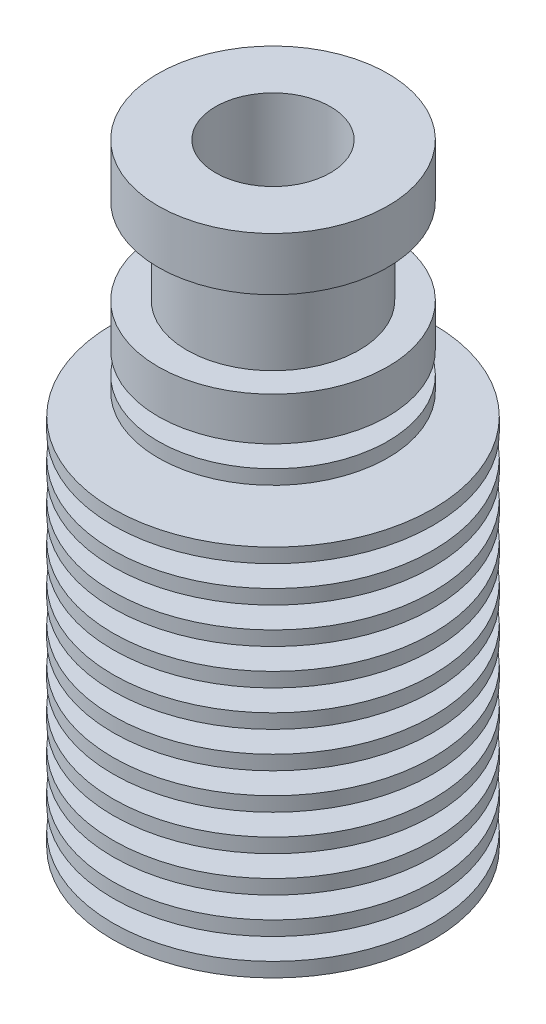
ISO-10303-21;
HEADER;
FILE_DESCRIPTION(('STEP AP214'),'2;1');
FILE_NAME('part.step','',(''),(''),'','','');
FILE_SCHEMA(('AUTOMOTIVE_DESIGN { 1 0 10303 214 1 1 1 1 }'));
ENDSEC;
DATA;
#1=APPLICATION_CONTEXT('core data for automotive mechanical design processes');
#2=APPLICATION_PROTOCOL_DEFINITION('international standard','automotive_design',2000,#1);
#3=PRODUCT_CONTEXT('',#1,'mechanical');
#4=PRODUCT('Part','Part','',(#3));
#5=PRODUCT_RELATED_PRODUCT_CATEGORY('part','',(#4));
#6=PRODUCT_DEFINITION_FORMATION('','',#4);
#7=PRODUCT_DEFINITION_CONTEXT('part definition',#1,'design');
#8=PRODUCT_DEFINITION('design','',#6,#7);
#9=PRODUCT_DEFINITION_SHAPE('','',#8);
#10=(LENGTH_UNIT() NAMED_UNIT(*) SI_UNIT(.MILLI.,.METRE.));
#11=(NAMED_UNIT(*) PLANE_ANGLE_UNIT() SI_UNIT($,.RADIAN.));
#12=(NAMED_UNIT(*) SI_UNIT($,.STERADIAN.) SOLID_ANGLE_UNIT());
#13=UNCERTAINTY_MEASURE_WITH_UNIT(LENGTH_MEASURE(1.E-05),#10,'distance_accuracy_value','');
#14=(GEOMETRIC_REPRESENTATION_CONTEXT(3) GLOBAL_UNCERTAINTY_ASSIGNED_CONTEXT((#13)) GLOBAL_UNIT_ASSIGNED_CONTEXT((#10,
#11,#12)) REPRESENTATION_CONTEXT('',''));
#15=CARTESIAN_POINT('',(0.,0.,0.));
#16=DIRECTION('',(0.,0.,1.));
#17=DIRECTION('',(1.,0.,0.));
#18=AXIS2_PLACEMENT_3D('',#15,#16,#17);
#19=CARTESIAN_POINT('',(0.,21.35,0.));
#20=DIRECTION('',(0.,1.,0.));
#21=DIRECTION('',(0.,0.,1.));
#22=AXIS2_PLACEMENT_3D('',#19,#20,#21);
#23=CYLINDRICAL_SURFACE('',#22,2.09999999999999);
#24=CARTESIAN_POINT('',(0.,-5.74170962313451,0.));
#25=DIRECTION('',(0.,1.,0.));
#26=DIRECTION('',(0.,0.,1.));
#27=AXIS2_PLACEMENT_3D('',#24,#25,#26);
#28=CIRCLE('',#27,2.09999999999999);
#29=CARTESIAN_POINT('',(0.,-5.74170962313451,2.09999999999999));
#30=VERTEX_POINT('',#29);
#31=EDGE_CURVE('E10',#30,#30,#28,.T.);
#32=ORIENTED_EDGE('',*,*,#31,.F.);
#33=EDGE_LOOP('',(#32));
#34=FACE_BOUND('',#33,.T.);
#35=CARTESIAN_POINT('',(0.,14.0196056774015,0.));
#36=DIRECTION('',(0.,1.,0.));
#37=DIRECTION('',(0.,0.,1.));
#38=AXIS2_PLACEMENT_3D('',#35,#36,#37);
#39=CIRCLE('',#38,2.09999999999999);
#40=CARTESIAN_POINT('',(0.,14.0196056774015,2.09999999999999));
#41=VERTEX_POINT('',#40);
#42=EDGE_CURVE('E216',#41,#41,#39,.T.);
#43=ORIENTED_EDGE('',*,*,#42,.T.);
#44=EDGE_LOOP('',(#43));
#45=FACE_BOUND('',#44,.T.);
#46=ADVANCED_FACE('F32',(#34,#45),#23,.F.);
#47=CARTESIAN_POINT('',(0.,-5.74170962313451,0.));
#48=DIRECTION('',(0.,-1.,0.));
#49=DIRECTION('',(0.,0.,-1.));
#50=AXIS2_PLACEMENT_3D('',#47,#48,#49);
#51=CONICAL_SURFACE('',#50,2.09999999999999,1.04719755119659);
#52=CARTESIAN_POINT('',(0.,-6.55,0.));
#53=DIRECTION('',(0.,1.,0.));
#54=DIRECTION('',(0.,0.,1.));
#55=AXIS2_PLACEMENT_3D('',#52,#53,#54);
#56=CIRCLE('',#55,3.49999999999999);
#57=CARTESIAN_POINT('',(0.,-6.55,3.49999999999999));
#58=VERTEX_POINT('',#57);
#59=EDGE_CURVE('E38',#58,#58,#56,.T.);
#60=ORIENTED_EDGE('',*,*,#59,.F.);
#61=EDGE_LOOP('',(#60));
#62=FACE_BOUND('',#61,.T.);
#63=ORIENTED_EDGE('',*,*,#31,.T.);
#64=EDGE_LOOP('',(#63));
#65=FACE_BOUND('',#64,.T.);
#66=ADVANCED_FACE('F245',(#62,#65),#51,.F.);
#67=CARTESIAN_POINT('',(0.,21.35,0.));
#68=DIRECTION('',(0.,1.,0.));
#69=DIRECTION('',(0.,0.,1.));
#70=AXIS2_PLACEMENT_3D('',#67,#68,#69);
#71=CYLINDRICAL_SURFACE('',#70,3.49999999999999);
#72=ORIENTED_EDGE('',*,*,#59,.T.);
#73=EDGE_LOOP('',(#72));
#74=FACE_BOUND('',#73,.T.);
#75=CARTESIAN_POINT('',(0.,-21.35,0.));
#76=DIRECTION('',(0.,1.,0.));
#77=DIRECTION('',(0.,0.,1.));
#78=AXIS2_PLACEMENT_3D('',#75,#76,#77);
#79=CIRCLE('',#78,3.49999999999999);
#80=CARTESIAN_POINT('',(0.,-21.35,3.49999999999999));
#81=VERTEX_POINT('',#80);
#82=EDGE_CURVE('E42',#81,#81,#79,.T.);
#83=ORIENTED_EDGE('',*,*,#82,.F.);
#84=EDGE_LOOP('',(#83));
#85=FACE_BOUND('',#84,.T.);
#86=ADVANCED_FACE('F250',(#74,#85),#71,.F.);
#87=CARTESIAN_POINT('',(0.,-21.35,0.));
#88=DIRECTION('',(0.,-1.,0.));
#89=DIRECTION('',(0.,0.,-1.));
#90=AXIS2_PLACEMENT_3D('',#87,#88,#89);
#91=PLANE('',#90);
#92=ORIENTED_EDGE('',*,*,#82,.T.);
#93=EDGE_LOOP('',(#92));
#94=FACE_BOUND('',#93,.T.);
#95=CARTESIAN_POINT('',(0.,-21.35,0.));
#96=DIRECTION('',(0.,1.,0.));
#97=DIRECTION('',(0.,0.,1.));
#98=AXIS2_PLACEMENT_3D('',#95,#96,#97);
#99=CIRCLE('',#98,11.15);
#100=CARTESIAN_POINT('',(0.,-21.35,11.15));
#101=VERTEX_POINT('',#100);
#102=EDGE_CURVE('E46',#101,#101,#99,.T.);
#103=ORIENTED_EDGE('',*,*,#102,.F.);
#104=EDGE_LOOP('',(#103));
#105=FACE_BOUND('',#104,.T.);
#106=ADVANCED_FACE('F255',(#94,#105),#91,.T.);
#107=CARTESIAN_POINT('',(0.,21.35,0.));
#108=DIRECTION('',(0.,1.,0.));
#109=DIRECTION('',(0.,0.,1.));
#110=AXIS2_PLACEMENT_3D('',#107,#108,#109);
#111=CYLINDRICAL_SURFACE('',#110,11.15);
#112=ORIENTED_EDGE('',*,*,#102,.T.);
#113=EDGE_LOOP('',(#112));
#114=FACE_BOUND('',#113,.T.);
#115=CARTESIAN_POINT('',(0.,-20.35,0.));
#116=DIRECTION('',(0.,1.,0.));
#117=DIRECTION('',(0.,0.,1.));
#118=AXIS2_PLACEMENT_3D('',#115,#116,#117);
#119=CIRCLE('',#118,11.15);
#120=CARTESIAN_POINT('',(0.,-20.35,11.15));
#121=VERTEX_POINT('',#120);
#122=EDGE_CURVE('E51',#121,#121,#119,.T.);
#123=ORIENTED_EDGE('',*,*,#122,.F.);
#124=EDGE_LOOP('',(#123));
#125=FACE_BOUND('',#124,.T.);
#126=ADVANCED_FACE('F260',(#114,#125),#111,.T.);
#127=CARTESIAN_POINT('',(0.,-20.35,0.));
#128=DIRECTION('',(0.,1.,0.));
#129=DIRECTION('',(0.,0.,1.));
#130=AXIS2_PLACEMENT_3D('',#127,#128,#129);
#131=PLANE('',#130);
#132=ORIENTED_EDGE('',*,*,#122,.T.);
#133=EDGE_LOOP('',(#132));
#134=FACE_BOUND('',#133,.T.);
#135=CARTESIAN_POINT('',(0.,-20.35,0.));
#136=DIRECTION('',(0.,1.,0.));
#137=DIRECTION('',(0.,0.,1.));
#138=AXIS2_PLACEMENT_3D('',#135,#136,#137);
#139=CIRCLE('',#138,6.25);
#140=CARTESIAN_POINT('',(0.,-20.35,6.25));
#141=VERTEX_POINT('',#140);
#142=EDGE_CURVE('E54',#141,#141,#139,.T.);
#143=ORIENTED_EDGE('',*,*,#142,.F.);
#144=EDGE_LOOP('',(#143));
#145=FACE_BOUND('',#144,.T.);
#146=ADVANCED_FACE('F264',(#134,#145),#131,.T.);
#147=CARTESIAN_POINT('',(0.,21.35,0.));
#148=DIRECTION('',(0.,1.,0.));
#149=DIRECTION('',(0.,0.,1.));
#150=AXIS2_PLACEMENT_3D('',#147,#148,#149);
#151=CYLINDRICAL_SURFACE('',#150,6.25);
#152=ORIENTED_EDGE('',*,*,#142,.T.);
#153=EDGE_LOOP('',(#152));
#154=FACE_BOUND('',#153,.T.);
#155=CARTESIAN_POINT('',(0.,-18.85,0.));
#156=DIRECTION('',(0.,1.,0.));
#157=DIRECTION('',(0.,0.,1.));
#158=AXIS2_PLACEMENT_3D('',#155,#156,#157);
#159=CIRCLE('',#158,6.25);
#160=CARTESIAN_POINT('',(0.,-18.85,6.25));
#161=VERTEX_POINT('',#160);
#162=EDGE_CURVE('E57',#161,#161,#159,.T.);
#163=ORIENTED_EDGE('',*,*,#162,.F.);
#164=EDGE_LOOP('',(#163));
#165=FACE_BOUND('',#164,.T.);
#166=ADVANCED_FACE('F268',(#154,#165),#151,.T.);
#167=CARTESIAN_POINT('',(0.,-18.85,0.));
#168=DIRECTION('',(0.,-1.,0.));
#169=DIRECTION('',(0.,0.,-1.));
#170=AXIS2_PLACEMENT_3D('',#167,#168,#169);
#171=PLANE('',#170);
#172=ORIENTED_EDGE('',*,*,#162,.T.);
#173=EDGE_LOOP('',(#172));
#174=FACE_BOUND('',#173,.T.);
#175=CARTESIAN_POINT('',(0.,-18.85,0.));
#176=DIRECTION('',(0.,1.,0.));
#177=DIRECTION('',(0.,0.,1.));
#178=AXIS2_PLACEMENT_3D('',#175,#176,#177);
#179=CIRCLE('',#178,11.15);
#180=CARTESIAN_POINT('',(0.,-18.85,11.15));
#181=VERTEX_POINT('',#180);
#182=EDGE_CURVE('E60',#181,#181,#179,.T.);
#183=ORIENTED_EDGE('',*,*,#182,.F.);
#184=EDGE_LOOP('',(#183));
#185=FACE_BOUND('',#184,.T.);
#186=ADVANCED_FACE('F272',(#174,#185),#171,.T.);
#187=CARTESIAN_POINT('',(0.,21.35,0.));
#188=DIRECTION('',(0.,1.,0.));
#189=DIRECTION('',(0.,0.,1.));
#190=AXIS2_PLACEMENT_3D('',#187,#188,#189);
#191=CYLINDRICAL_SURFACE('',#190,11.15);
#192=CARTESIAN_POINT('',(0.,-17.85,0.));
#193=DIRECTION('',(0.,1.,0.));
#194=DIRECTION('',(0.,0.,1.));
#195=AXIS2_PLACEMENT_3D('',#192,#193,#194);
#196=CIRCLE('',#195,11.15);
#197=CARTESIAN_POINT('',(0.,-17.85,11.15));
#198=VERTEX_POINT('',#197);
#199=EDGE_CURVE('E63',#198,#198,#196,.T.);
#200=ORIENTED_EDGE('',*,*,#199,.F.);
#201=EDGE_LOOP('',(#200));
#202=FACE_BOUND('',#201,.T.);
#203=ORIENTED_EDGE('',*,*,#182,.T.);
#204=EDGE_LOOP('',(#203));
#205=FACE_BOUND('',#204,.T.);
#206=ADVANCED_FACE('F276',(#202,#205),#191,.T.);
#207=CARTESIAN_POINT('',(0.,-17.85,0.));
#208=DIRECTION('',(0.,1.,0.));
#209=DIRECTION('',(0.,0.,1.));
#210=AXIS2_PLACEMENT_3D('',#207,#208,#209);
#211=PLANE('',#210);
#212=ORIENTED_EDGE('',*,*,#199,.T.);
#213=EDGE_LOOP('',(#212));
#214=FACE_BOUND('',#213,.T.);
#215=CARTESIAN_POINT('',(0.,-17.85,0.));
#216=DIRECTION('',(0.,1.,0.));
#217=DIRECTION('',(0.,0.,1.));
#218=AXIS2_PLACEMENT_3D('',#215,#216,#217);
#219=CIRCLE('',#218,6.05);
#220=CARTESIAN_POINT('',(0.,-17.85,6.05));
#221=VERTEX_POINT('',#220);
#222=EDGE_CURVE('E66',#221,#221,#219,.T.);
#223=ORIENTED_EDGE('',*,*,#222,.F.);
#224=EDGE_LOOP('',(#223));
#225=FACE_BOUND('',#224,.T.);
#226=ADVANCED_FACE('F280',(#214,#225),#211,.T.);
#227=CARTESIAN_POINT('',(0.,21.35,0.));
#228=DIRECTION('',(0.,1.,0.));
#229=DIRECTION('',(0.,0.,1.));
#230=AXIS2_PLACEMENT_3D('',#227,#228,#229);
#231=CYLINDRICAL_SURFACE('',#230,6.05);
#232=ORIENTED_EDGE('',*,*,#222,.T.);
#233=EDGE_LOOP('',(#232));
#234=FACE_BOUND('',#233,.T.);
#235=CARTESIAN_POINT('',(0.,-16.35,0.));
#236=DIRECTION('',(0.,1.,0.));
#237=DIRECTION('',(0.,0.,1.));
#238=AXIS2_PLACEMENT_3D('',#235,#236,#237);
#239=CIRCLE('',#238,6.05);
#240=CARTESIAN_POINT('',(0.,-16.35,6.05));
#241=VERTEX_POINT('',#240);
#242=EDGE_CURVE('E69',#241,#241,#239,.T.);
#243=ORIENTED_EDGE('',*,*,#242,.F.);
#244=EDGE_LOOP('',(#243));
#245=FACE_BOUND('',#244,.T.);
#246=ADVANCED_FACE('F284',(#234,#245),#231,.T.);
#247=CARTESIAN_POINT('',(0.,-16.35,0.));
#248=DIRECTION('',(0.,1.,0.));
#249=DIRECTION('',(0.,0.,1.));
#250=AXIS2_PLACEMENT_3D('',#247,#248,#249);
#251=PLANE('',#250);
#252=CARTESIAN_POINT('',(0.,-16.35,0.));
#253=DIRECTION('',(0.,1.,0.));
#254=DIRECTION('',(0.,0.,1.));
#255=AXIS2_PLACEMENT_3D('',#252,#253,#254);
#256=CIRCLE('',#255,11.15);
#257=CARTESIAN_POINT('',(0.,-16.35,11.15));
#258=VERTEX_POINT('',#257);
#259=EDGE_CURVE('E72',#258,#258,#256,.T.);
#260=ORIENTED_EDGE('',*,*,#259,.F.);
#261=EDGE_LOOP('',(#260));
#262=FACE_BOUND('',#261,.T.);
#263=ORIENTED_EDGE('',*,*,#242,.T.);
#264=EDGE_LOOP('',(#263));
#265=FACE_BOUND('',#264,.T.);
#266=ADVANCED_FACE('F288',(#262,#265),#251,.F.);
#267=CARTESIAN_POINT('',(0.,21.35,0.));
#268=DIRECTION('',(0.,1.,0.));
#269=DIRECTION('',(0.,0.,1.));
#270=AXIS2_PLACEMENT_3D('',#267,#268,#269);
#271=CYLINDRICAL_SURFACE('',#270,11.15);
#272=CARTESIAN_POINT('',(0.,-15.35,0.));
#273=DIRECTION('',(0.,1.,0.));
#274=DIRECTION('',(0.,0.,1.));
#275=AXIS2_PLACEMENT_3D('',#272,#273,#274);
#276=CIRCLE('',#275,11.15);
#277=CARTESIAN_POINT('',(0.,-15.35,11.15));
#278=VERTEX_POINT('',#277);
#279=EDGE_CURVE('E75',#278,#278,#276,.T.);
#280=ORIENTED_EDGE('',*,*,#279,.F.);
#281=EDGE_LOOP('',(#280));
#282=FACE_BOUND('',#281,.T.);
#283=ORIENTED_EDGE('',*,*,#259,.T.);
#284=EDGE_LOOP('',(#283));
#285=FACE_BOUND('',#284,.T.);
#286=ADVANCED_FACE('F292',(#282,#285),#271,.T.);
#287=CARTESIAN_POINT('',(0.,-15.35,0.));
#288=DIRECTION('',(0.,-1.,0.));
#289=DIRECTION('',(0.,0.,-1.));
#290=AXIS2_PLACEMENT_3D('',#287,#288,#289);
#291=PLANE('',#290);
#292=CARTESIAN_POINT('',(0.,-15.35,0.));
#293=DIRECTION('',(0.,1.,0.));
#294=DIRECTION('',(0.,0.,1.));
#295=AXIS2_PLACEMENT_3D('',#292,#293,#294);
#296=CIRCLE('',#295,5.9);
#297=CARTESIAN_POINT('',(0.,-15.35,5.9));
#298=VERTEX_POINT('',#297);
#299=EDGE_CURVE('E78',#298,#298,#296,.T.);
#300=ORIENTED_EDGE('',*,*,#299,.F.);
#301=EDGE_LOOP('',(#300));
#302=FACE_BOUND('',#301,.T.);
#303=ORIENTED_EDGE('',*,*,#279,.T.);
#304=EDGE_LOOP('',(#303));
#305=FACE_BOUND('',#304,.T.);
#306=ADVANCED_FACE('F296',(#302,#305),#291,.F.);
#307=CARTESIAN_POINT('',(0.,21.35,0.));
#308=DIRECTION('',(0.,1.,0.));
#309=DIRECTION('',(0.,0.,1.));
#310=AXIS2_PLACEMENT_3D('',#307,#308,#309);
#311=CYLINDRICAL_SURFACE('',#310,5.9);
#312=CARTESIAN_POINT('',(0.,-13.85,0.));
#313=DIRECTION('',(0.,1.,0.));
#314=DIRECTION('',(0.,0.,1.));
#315=AXIS2_PLACEMENT_3D('',#312,#313,#314);
#316=CIRCLE('',#315,5.9);
#317=CARTESIAN_POINT('',(0.,-13.85,5.9));
#318=VERTEX_POINT('',#317);
#319=EDGE_CURVE('E81',#318,#318,#316,.T.);
#320=ORIENTED_EDGE('',*,*,#319,.F.);
#321=EDGE_LOOP('',(#320));
#322=FACE_BOUND('',#321,.T.);
#323=ORIENTED_EDGE('',*,*,#299,.T.);
#324=EDGE_LOOP('',(#323));
#325=FACE_BOUND('',#324,.T.);
#326=ADVANCED_FACE('F300',(#322,#325),#311,.T.);
#327=CARTESIAN_POINT('',(0.,-13.85,0.));
#328=DIRECTION('',(0.,-1.,0.));
#329=DIRECTION('',(0.,0.,-1.));
#330=AXIS2_PLACEMENT_3D('',#327,#328,#329);
#331=PLANE('',#330);
#332=ORIENTED_EDGE('',*,*,#319,.T.);
#333=EDGE_LOOP('',(#332));
#334=FACE_BOUND('',#333,.T.);
#335=CARTESIAN_POINT('',(0.,-13.85,0.));
#336=DIRECTION('',(0.,1.,0.));
#337=DIRECTION('',(0.,0.,1.));
#338=AXIS2_PLACEMENT_3D('',#335,#336,#337);
#339=CIRCLE('',#338,11.15);
#340=CARTESIAN_POINT('',(0.,-13.85,11.15));
#341=VERTEX_POINT('',#340);
#342=EDGE_CURVE('E84',#341,#341,#339,.T.);
#343=ORIENTED_EDGE('',*,*,#342,.F.);
#344=EDGE_LOOP('',(#343));
#345=FACE_BOUND('',#344,.T.);
#346=ADVANCED_FACE('F304',(#334,#345),#331,.T.);
#347=CARTESIAN_POINT('',(0.,21.35,0.));
#348=DIRECTION('',(0.,1.,0.));
#349=DIRECTION('',(0.,0.,1.));
#350=AXIS2_PLACEMENT_3D('',#347,#348,#349);
#351=CYLINDRICAL_SURFACE('',#350,11.15);
#352=ORIENTED_EDGE('',*,*,#342,.T.);
#353=EDGE_LOOP('',(#352));
#354=FACE_BOUND('',#353,.T.);
#355=CARTESIAN_POINT('',(0.,-12.85,0.));
#356=DIRECTION('',(0.,1.,0.));
#357=DIRECTION('',(0.,0.,1.));
#358=AXIS2_PLACEMENT_3D('',#355,#356,#357);
#359=CIRCLE('',#358,11.15);
#360=CARTESIAN_POINT('',(0.,-12.85,11.15));
#361=VERTEX_POINT('',#360);
#362=EDGE_CURVE('E87',#361,#361,#359,.T.);
#363=ORIENTED_EDGE('',*,*,#362,.F.);
#364=EDGE_LOOP('',(#363));
#365=FACE_BOUND('',#364,.T.);
#366=ADVANCED_FACE('F308',(#354,#365),#351,.T.);
#367=CARTESIAN_POINT('',(0.,-12.85,0.));
#368=DIRECTION('',(0.,1.,0.));
#369=DIRECTION('',(0.,0.,1.));
#370=AXIS2_PLACEMENT_3D('',#367,#368,#369);
#371=PLANE('',#370);
#372=ORIENTED_EDGE('',*,*,#362,.T.);
#373=EDGE_LOOP('',(#372));
#374=FACE_BOUND('',#373,.T.);
#375=CARTESIAN_POINT('',(0.,-12.85,0.));
#376=DIRECTION('',(0.,1.,0.));
#377=DIRECTION('',(0.,0.,1.));
#378=AXIS2_PLACEMENT_3D('',#375,#376,#377);
#379=CIRCLE('',#378,5.7);
#380=CARTESIAN_POINT('',(0.,-12.85,5.7));
#381=VERTEX_POINT('',#380);
#382=EDGE_CURVE('E90',#381,#381,#379,.T.);
#383=ORIENTED_EDGE('',*,*,#382,.F.);
#384=EDGE_LOOP('',(#383));
#385=FACE_BOUND('',#384,.T.);
#386=ADVANCED_FACE('F312',(#374,#385),#371,.T.);
#387=CARTESIAN_POINT('',(0.,21.35,0.));
#388=DIRECTION('',(0.,1.,0.));
#389=DIRECTION('',(0.,0.,1.));
#390=AXIS2_PLACEMENT_3D('',#387,#388,#389);
#391=CYLINDRICAL_SURFACE('',#390,5.7);
#392=ORIENTED_EDGE('',*,*,#382,.T.);
#393=EDGE_LOOP('',(#392));
#394=FACE_BOUND('',#393,.T.);
#395=CARTESIAN_POINT('',(0.,-11.35,0.));
#396=DIRECTION('',(0.,1.,0.));
#397=DIRECTION('',(0.,0.,1.));
#398=AXIS2_PLACEMENT_3D('',#395,#396,#397);
#399=CIRCLE('',#398,5.7);
#400=CARTESIAN_POINT('',(0.,-11.35,5.7));
#401=VERTEX_POINT('',#400);
#402=EDGE_CURVE('E93',#401,#401,#399,.T.);
#403=ORIENTED_EDGE('',*,*,#402,.F.);
#404=EDGE_LOOP('',(#403));
#405=FACE_BOUND('',#404,.T.);
#406=ADVANCED_FACE('F316',(#394,#405),#391,.T.);
#407=CARTESIAN_POINT('',(0.,-11.35,0.));
#408=DIRECTION('',(0.,-1.,0.));
#409=DIRECTION('',(0.,0.,-1.));
#410=AXIS2_PLACEMENT_3D('',#407,#408,#409);
#411=PLANE('',#410);
#412=ORIENTED_EDGE('',*,*,#402,.T.);
#413=EDGE_LOOP('',(#412));
#414=FACE_BOUND('',#413,.T.);
#415=CARTESIAN_POINT('',(0.,-11.35,0.));
#416=DIRECTION('',(0.,1.,0.));
#417=DIRECTION('',(0.,0.,1.));
#418=AXIS2_PLACEMENT_3D('',#415,#416,#417);
#419=CIRCLE('',#418,11.15);
#420=CARTESIAN_POINT('',(0.,-11.35,11.15));
#421=VERTEX_POINT('',#420);
#422=EDGE_CURVE('E96',#421,#421,#419,.T.);
#423=ORIENTED_EDGE('',*,*,#422,.F.);
#424=EDGE_LOOP('',(#423));
#425=FACE_BOUND('',#424,.T.);
#426=ADVANCED_FACE('F320',(#414,#425),#411,.T.);
#427=CARTESIAN_POINT('',(0.,21.35,0.));
#428=DIRECTION('',(0.,1.,0.));
#429=DIRECTION('',(0.,0.,1.));
#430=AXIS2_PLACEMENT_3D('',#427,#428,#429);
#431=CYLINDRICAL_SURFACE('',#430,11.15);
#432=ORIENTED_EDGE('',*,*,#422,.T.);
#433=EDGE_LOOP('',(#432));
#434=FACE_BOUND('',#433,.T.);
#435=CARTESIAN_POINT('',(0.,-10.35,0.));
#436=DIRECTION('',(0.,1.,0.));
#437=DIRECTION('',(0.,0.,1.));
#438=AXIS2_PLACEMENT_3D('',#435,#436,#437);
#439=CIRCLE('',#438,11.15);
#440=CARTESIAN_POINT('',(0.,-10.35,11.15));
#441=VERTEX_POINT('',#440);
#442=EDGE_CURVE('E99',#441,#441,#439,.T.);
#443=ORIENTED_EDGE('',*,*,#442,.F.);
#444=EDGE_LOOP('',(#443));
#445=FACE_BOUND('',#444,.T.);
#446=ADVANCED_FACE('F324',(#434,#445),#431,.T.);
#447=CARTESIAN_POINT('',(0.,-10.35,0.));
#448=DIRECTION('',(0.,1.,0.));
#449=DIRECTION('',(0.,0.,1.));
#450=AXIS2_PLACEMENT_3D('',#447,#448,#449);
#451=PLANE('',#450);
#452=ORIENTED_EDGE('',*,*,#442,.T.);
#453=EDGE_LOOP('',(#452));
#454=FACE_BOUND('',#453,.T.);
#455=CARTESIAN_POINT('',(0.,-10.35,0.));
#456=DIRECTION('',(0.,1.,0.));
#457=DIRECTION('',(0.,0.,1.));
#458=AXIS2_PLACEMENT_3D('',#455,#456,#457);
#459=CIRCLE('',#458,5.5);
#460=CARTESIAN_POINT('',(0.,-10.35,5.5));
#461=VERTEX_POINT('',#460);
#462=EDGE_CURVE('E102',#461,#461,#459,.T.);
#463=ORIENTED_EDGE('',*,*,#462,.F.);
#464=EDGE_LOOP('',(#463));
#465=FACE_BOUND('',#464,.T.);
#466=ADVANCED_FACE('F328',(#454,#465),#451,.T.);
#467=CARTESIAN_POINT('',(0.,21.35,0.));
#468=DIRECTION('',(0.,1.,0.));
#469=DIRECTION('',(0.,0.,1.));
#470=AXIS2_PLACEMENT_3D('',#467,#468,#469);
#471=CYLINDRICAL_SURFACE('',#470,5.5);
#472=ORIENTED_EDGE('',*,*,#462,.T.);
#473=EDGE_LOOP('',(#472));
#474=FACE_BOUND('',#473,.T.);
#475=CARTESIAN_POINT('',(0.,-8.85,0.));
#476=DIRECTION('',(0.,1.,0.));
#477=DIRECTION('',(0.,0.,1.));
#478=AXIS2_PLACEMENT_3D('',#475,#476,#477);
#479=CIRCLE('',#478,5.5);
#480=CARTESIAN_POINT('',(0.,-8.85,5.5));
#481=VERTEX_POINT('',#480);
#482=EDGE_CURVE('E105',#481,#481,#479,.T.);
#483=ORIENTED_EDGE('',*,*,#482,.F.);
#484=EDGE_LOOP('',(#483));
#485=FACE_BOUND('',#484,.T.);
#486=ADVANCED_FACE('F332',(#474,#485),#471,.T.);
#487=CARTESIAN_POINT('',(0.,-8.85,0.));
#488=DIRECTION('',(0.,-1.,0.));
#489=DIRECTION('',(0.,0.,-1.));
#490=AXIS2_PLACEMENT_3D('',#487,#488,#489);
#491=PLANE('',#490);
#492=ORIENTED_EDGE('',*,*,#482,.T.);
#493=EDGE_LOOP('',(#492));
#494=FACE_BOUND('',#493,.T.);
#495=CARTESIAN_POINT('',(0.,-8.85,0.));
#496=DIRECTION('',(0.,1.,0.));
#497=DIRECTION('',(0.,0.,1.));
#498=AXIS2_PLACEMENT_3D('',#495,#496,#497);
#499=CIRCLE('',#498,11.15);
#500=CARTESIAN_POINT('',(0.,-8.85,11.15));
#501=VERTEX_POINT('',#500);
#502=EDGE_CURVE('E108',#501,#501,#499,.T.);
#503=ORIENTED_EDGE('',*,*,#502,.F.);
#504=EDGE_LOOP('',(#503));
#505=FACE_BOUND('',#504,.T.);
#506=ADVANCED_FACE('F336',(#494,#505),#491,.T.);
#507=CARTESIAN_POINT('',(0.,21.35,0.));
#508=DIRECTION('',(0.,1.,0.));
#509=DIRECTION('',(0.,0.,1.));
#510=AXIS2_PLACEMENT_3D('',#507,#508,#509);
#511=CYLINDRICAL_SURFACE('',#510,11.15);
#512=ORIENTED_EDGE('',*,*,#502,.T.);
#513=EDGE_LOOP('',(#512));
#514=FACE_BOUND('',#513,.T.);
#515=CARTESIAN_POINT('',(0.,-7.85,0.));
#516=DIRECTION('',(0.,1.,0.));
#517=DIRECTION('',(0.,0.,1.));
#518=AXIS2_PLACEMENT_3D('',#515,#516,#517);
#519=CIRCLE('',#518,11.15);
#520=CARTESIAN_POINT('',(0.,-7.85,11.15));
#521=VERTEX_POINT('',#520);
#522=EDGE_CURVE('E111',#521,#521,#519,.T.);
#523=ORIENTED_EDGE('',*,*,#522,.F.);
#524=EDGE_LOOP('',(#523));
#525=FACE_BOUND('',#524,.T.);
#526=ADVANCED_FACE('F340',(#514,#525),#511,.T.);
#527=CARTESIAN_POINT('',(0.,-7.85,0.));
#528=DIRECTION('',(0.,1.,0.));
#529=DIRECTION('',(0.,0.,1.));
#530=AXIS2_PLACEMENT_3D('',#527,#528,#529);
#531=PLANE('',#530);
#532=ORIENTED_EDGE('',*,*,#522,.T.);
#533=EDGE_LOOP('',(#532));
#534=FACE_BOUND('',#533,.T.);
#535=CARTESIAN_POINT('',(0.,-7.85,0.));
#536=DIRECTION('',(0.,1.,0.));
#537=DIRECTION('',(0.,0.,1.));
#538=AXIS2_PLACEMENT_3D('',#535,#536,#537);
#539=CIRCLE('',#538,5.35);
#540=CARTESIAN_POINT('',(0.,-7.85,5.35));
#541=VERTEX_POINT('',#540);
#542=EDGE_CURVE('E114',#541,#541,#539,.T.);
#543=ORIENTED_EDGE('',*,*,#542,.F.);
#544=EDGE_LOOP('',(#543));
#545=FACE_BOUND('',#544,.T.);
#546=ADVANCED_FACE('F344',(#534,#545),#531,.T.);
#547=CARTESIAN_POINT('',(0.,21.35,0.));
#548=DIRECTION('',(0.,1.,0.));
#549=DIRECTION('',(0.,0.,1.));
#550=AXIS2_PLACEMENT_3D('',#547,#548,#549);
#551=CYLINDRICAL_SURFACE('',#550,5.35);
#552=ORIENTED_EDGE('',*,*,#542,.T.);
#553=EDGE_LOOP('',(#552));
#554=FACE_BOUND('',#553,.T.);
#555=CARTESIAN_POINT('',(0.,-6.35,0.));
#556=DIRECTION('',(0.,1.,0.));
#557=DIRECTION('',(0.,0.,1.));
#558=AXIS2_PLACEMENT_3D('',#555,#556,#557);
#559=CIRCLE('',#558,5.35);
#560=CARTESIAN_POINT('',(0.,-6.35,5.35));
#561=VERTEX_POINT('',#560);
#562=EDGE_CURVE('E117',#561,#561,#559,.T.);
#563=ORIENTED_EDGE('',*,*,#562,.F.);
#564=EDGE_LOOP('',(#563));
#565=FACE_BOUND('',#564,.T.);
#566=ADVANCED_FACE('F348',(#554,#565),#551,.T.);
#567=CARTESIAN_POINT('',(0.,-6.35,0.));
#568=DIRECTION('',(0.,-1.,0.));
#569=DIRECTION('',(0.,0.,-1.));
#570=AXIS2_PLACEMENT_3D('',#567,#568,#569);
#571=PLANE('',#570);
#572=ORIENTED_EDGE('',*,*,#562,.T.);
#573=EDGE_LOOP('',(#572));
#574=FACE_BOUND('',#573,.T.);
#575=CARTESIAN_POINT('',(0.,-6.34999999999999,0.));
#576=DIRECTION('',(0.,1.,0.));
#577=DIRECTION('',(0.,0.,1.));
#578=AXIS2_PLACEMENT_3D('',#575,#576,#577);
#579=CIRCLE('',#578,11.15);
#580=CARTESIAN_POINT('',(0.,-6.34999999999999,11.15));
#581=VERTEX_POINT('',#580);
#582=EDGE_CURVE('E120',#581,#581,#579,.T.);
#583=ORIENTED_EDGE('',*,*,#582,.F.);
#584=EDGE_LOOP('',(#583));
#585=FACE_BOUND('',#584,.T.);
#586=ADVANCED_FACE('F352',(#574,#585),#571,.T.);
#587=CARTESIAN_POINT('',(0.,21.35,0.));
#588=DIRECTION('',(0.,1.,0.));
#589=DIRECTION('',(0.,0.,1.));
#590=AXIS2_PLACEMENT_3D('',#587,#588,#589);
#591=CYLINDRICAL_SURFACE('',#590,11.15);
#592=ORIENTED_EDGE('',*,*,#582,.T.);
#593=EDGE_LOOP('',(#592));
#594=FACE_BOUND('',#593,.T.);
#595=CARTESIAN_POINT('',(0.,-5.35,0.));
#596=DIRECTION('',(0.,1.,0.));
#597=DIRECTION('',(0.,0.,1.));
#598=AXIS2_PLACEMENT_3D('',#595,#596,#597);
#599=CIRCLE('',#598,11.15);
#600=CARTESIAN_POINT('',(0.,-5.35,11.15));
#601=VERTEX_POINT('',#600);
#602=EDGE_CURVE('E123',#601,#601,#599,.T.);
#603=ORIENTED_EDGE('',*,*,#602,.F.);
#604=EDGE_LOOP('',(#603));
#605=FACE_BOUND('',#604,.T.);
#606=ADVANCED_FACE('F356',(#594,#605),#591,.T.);
#607=CARTESIAN_POINT('',(0.,-5.35,0.));
#608=DIRECTION('',(0.,1.,0.));
#609=DIRECTION('',(0.,0.,1.));
#610=AXIS2_PLACEMENT_3D('',#607,#608,#609);
#611=PLANE('',#610);
#612=ORIENTED_EDGE('',*,*,#602,.T.);
#613=EDGE_LOOP('',(#612));
#614=FACE_BOUND('',#613,.T.);
#615=CARTESIAN_POINT('',(0.,-5.35,0.));
#616=DIRECTION('',(0.,1.,0.));
#617=DIRECTION('',(0.,0.,1.));
#618=AXIS2_PLACEMENT_3D('',#615,#616,#617);
#619=CIRCLE('',#618,5.15);
#620=CARTESIAN_POINT('',(0.,-5.35,5.15));
#621=VERTEX_POINT('',#620);
#622=EDGE_CURVE('E126',#621,#621,#619,.T.);
#623=ORIENTED_EDGE('',*,*,#622,.F.);
#624=EDGE_LOOP('',(#623));
#625=FACE_BOUND('',#624,.T.);
#626=ADVANCED_FACE('F360',(#614,#625),#611,.T.);
#627=CARTESIAN_POINT('',(0.,21.35,0.));
#628=DIRECTION('',(0.,1.,0.));
#629=DIRECTION('',(0.,0.,1.));
#630=AXIS2_PLACEMENT_3D('',#627,#628,#629);
#631=CYLINDRICAL_SURFACE('',#630,5.15);
#632=ORIENTED_EDGE('',*,*,#622,.T.);
#633=EDGE_LOOP('',(#632));
#634=FACE_BOUND('',#633,.T.);
#635=CARTESIAN_POINT('',(0.,-3.85,0.));
#636=DIRECTION('',(0.,1.,0.));
#637=DIRECTION('',(0.,0.,1.));
#638=AXIS2_PLACEMENT_3D('',#635,#636,#637);
#639=CIRCLE('',#638,5.15);
#640=CARTESIAN_POINT('',(0.,-3.85,5.15));
#641=VERTEX_POINT('',#640);
#642=EDGE_CURVE('E129',#641,#641,#639,.T.);
#643=ORIENTED_EDGE('',*,*,#642,.F.);
#644=EDGE_LOOP('',(#643));
#645=FACE_BOUND('',#644,.T.);
#646=ADVANCED_FACE('F364',(#634,#645),#631,.T.);
#647=CARTESIAN_POINT('',(0.,-3.85,0.));
#648=DIRECTION('',(0.,-1.,0.));
#649=DIRECTION('',(0.,0.,-1.));
#650=AXIS2_PLACEMENT_3D('',#647,#648,#649);
#651=PLANE('',#650);
#652=ORIENTED_EDGE('',*,*,#642,.T.);
#653=EDGE_LOOP('',(#652));
#654=FACE_BOUND('',#653,.T.);
#655=CARTESIAN_POINT('',(0.,-3.85,0.));
#656=DIRECTION('',(0.,1.,0.));
#657=DIRECTION('',(0.,0.,1.));
#658=AXIS2_PLACEMENT_3D('',#655,#656,#657);
#659=CIRCLE('',#658,11.15);
#660=CARTESIAN_POINT('',(0.,-3.85,11.15));
#661=VERTEX_POINT('',#660);
#662=EDGE_CURVE('E132',#661,#661,#659,.T.);
#663=ORIENTED_EDGE('',*,*,#662,.F.);
#664=EDGE_LOOP('',(#663));
#665=FACE_BOUND('',#664,.T.);
#666=ADVANCED_FACE('F368',(#654,#665),#651,.T.);
#667=CARTESIAN_POINT('',(0.,21.35,0.));
#668=DIRECTION('',(0.,1.,0.));
#669=DIRECTION('',(0.,0.,1.));
#670=AXIS2_PLACEMENT_3D('',#667,#668,#669);
#671=CYLINDRICAL_SURFACE('',#670,11.15);
#672=ORIENTED_EDGE('',*,*,#662,.T.);
#673=EDGE_LOOP('',(#672));
#674=FACE_BOUND('',#673,.T.);
#675=CARTESIAN_POINT('',(0.,-2.84999999999999,0.));
#676=DIRECTION('',(0.,1.,0.));
#677=DIRECTION('',(0.,0.,1.));
#678=AXIS2_PLACEMENT_3D('',#675,#676,#677);
#679=CIRCLE('',#678,11.15);
#680=CARTESIAN_POINT('',(0.,-2.84999999999999,11.15));
#681=VERTEX_POINT('',#680);
#682=EDGE_CURVE('E135',#681,#681,#679,.T.);
#683=ORIENTED_EDGE('',*,*,#682,.F.);
#684=EDGE_LOOP('',(#683));
#685=FACE_BOUND('',#684,.T.);
#686=ADVANCED_FACE('F372',(#674,#685),#671,.T.);
#687=CARTESIAN_POINT('',(0.,-2.85,0.));
#688=DIRECTION('',(0.,1.,0.));
#689=DIRECTION('',(0.,0.,1.));
#690=AXIS2_PLACEMENT_3D('',#687,#688,#689);
#691=PLANE('',#690);
#692=ORIENTED_EDGE('',*,*,#682,.T.);
#693=EDGE_LOOP('',(#692));
#694=FACE_BOUND('',#693,.T.);
#695=CARTESIAN_POINT('',(0.,-2.85,0.));
#696=DIRECTION('',(0.,1.,0.));
#697=DIRECTION('',(0.,0.,1.));
#698=AXIS2_PLACEMENT_3D('',#695,#696,#697);
#699=CIRCLE('',#698,4.95);
#700=CARTESIAN_POINT('',(0.,-2.85,4.95));
#701=VERTEX_POINT('',#700);
#702=EDGE_CURVE('E138',#701,#701,#699,.T.);
#703=ORIENTED_EDGE('',*,*,#702,.F.);
#704=EDGE_LOOP('',(#703));
#705=FACE_BOUND('',#704,.T.);
#706=ADVANCED_FACE('F376',(#694,#705),#691,.T.);
#707=CARTESIAN_POINT('',(0.,21.35,0.));
#708=DIRECTION('',(0.,1.,0.));
#709=DIRECTION('',(0.,0.,1.));
#710=AXIS2_PLACEMENT_3D('',#707,#708,#709);
#711=CYLINDRICAL_SURFACE('',#710,4.95);
#712=ORIENTED_EDGE('',*,*,#702,.T.);
#713=EDGE_LOOP('',(#712));
#714=FACE_BOUND('',#713,.T.);
#715=CARTESIAN_POINT('',(0.,-1.35,0.));
#716=DIRECTION('',(0.,1.,0.));
#717=DIRECTION('',(0.,0.,1.));
#718=AXIS2_PLACEMENT_3D('',#715,#716,#717);
#719=CIRCLE('',#718,4.95);
#720=CARTESIAN_POINT('',(0.,-1.35,4.95));
#721=VERTEX_POINT('',#720);
#722=EDGE_CURVE('E141',#721,#721,#719,.T.);
#723=ORIENTED_EDGE('',*,*,#722,.F.);
#724=EDGE_LOOP('',(#723));
#725=FACE_BOUND('',#724,.T.);
#726=ADVANCED_FACE('F380',(#714,#725),#711,.T.);
#727=CARTESIAN_POINT('',(0.,-1.35,0.));
#728=DIRECTION('',(0.,-1.,0.));
#729=DIRECTION('',(0.,0.,-1.));
#730=AXIS2_PLACEMENT_3D('',#727,#728,#729);
#731=PLANE('',#730);
#732=ORIENTED_EDGE('',*,*,#722,.T.);
#733=EDGE_LOOP('',(#732));
#734=FACE_BOUND('',#733,.T.);
#735=CARTESIAN_POINT('',(0.,-1.35,0.));
#736=DIRECTION('',(0.,1.,0.));
#737=DIRECTION('',(0.,0.,1.));
#738=AXIS2_PLACEMENT_3D('',#735,#736,#737);
#739=CIRCLE('',#738,11.15);
#740=CARTESIAN_POINT('',(0.,-1.35,11.15));
#741=VERTEX_POINT('',#740);
#742=EDGE_CURVE('E144',#741,#741,#739,.T.);
#743=ORIENTED_EDGE('',*,*,#742,.F.);
#744=EDGE_LOOP('',(#743));
#745=FACE_BOUND('',#744,.T.);
#746=ADVANCED_FACE('F384',(#734,#745),#731,.T.);
#747=CARTESIAN_POINT('',(0.,21.35,0.));
#748=DIRECTION('',(0.,1.,0.));
#749=DIRECTION('',(0.,0.,1.));
#750=AXIS2_PLACEMENT_3D('',#747,#748,#749);
#751=CYLINDRICAL_SURFACE('',#750,11.15);
#752=ORIENTED_EDGE('',*,*,#742,.T.);
#753=EDGE_LOOP('',(#752));
#754=FACE_BOUND('',#753,.T.);
#755=CARTESIAN_POINT('',(0.,-0.349999999999996,0.));
#756=DIRECTION('',(0.,1.,0.));
#757=DIRECTION('',(0.,0.,1.));
#758=AXIS2_PLACEMENT_3D('',#755,#756,#757);
#759=CIRCLE('',#758,11.15);
#760=CARTESIAN_POINT('',(0.,-0.349999999999996,11.15));
#761=VERTEX_POINT('',#760);
#762=EDGE_CURVE('E147',#761,#761,#759,.T.);
#763=ORIENTED_EDGE('',*,*,#762,.F.);
#764=EDGE_LOOP('',(#763));
#765=FACE_BOUND('',#764,.T.);
#766=ADVANCED_FACE('F388',(#754,#765),#751,.T.);
#767=CARTESIAN_POINT('',(0.,-0.349999999999994,0.));
#768=DIRECTION('',(0.,1.,0.));
#769=DIRECTION('',(0.,0.,1.));
#770=AXIS2_PLACEMENT_3D('',#767,#768,#769);
#771=PLANE('',#770);
#772=ORIENTED_EDGE('',*,*,#762,.T.);
#773=EDGE_LOOP('',(#772));
#774=FACE_BOUND('',#773,.T.);
#775=CARTESIAN_POINT('',(0.,-0.349999999999993,0.));
#776=DIRECTION('',(0.,1.,0.));
#777=DIRECTION('',(0.,0.,1.));
#778=AXIS2_PLACEMENT_3D('',#775,#776,#777);
#779=CIRCLE('',#778,4.8);
#780=CARTESIAN_POINT('',(0.,-0.349999999999993,4.8));
#781=VERTEX_POINT('',#780);
#782=EDGE_CURVE('E150',#781,#781,#779,.T.);
#783=ORIENTED_EDGE('',*,*,#782,.F.);
#784=EDGE_LOOP('',(#783));
#785=FACE_BOUND('',#784,.T.);
#786=ADVANCED_FACE('F392',(#774,#785),#771,.T.);
#787=CARTESIAN_POINT('',(0.,21.35,0.));
#788=DIRECTION('',(0.,1.,0.));
#789=DIRECTION('',(0.,0.,1.));
#790=AXIS2_PLACEMENT_3D('',#787,#788,#789);
#791=CYLINDRICAL_SURFACE('',#790,4.8);
#792=ORIENTED_EDGE('',*,*,#782,.T.);
#793=EDGE_LOOP('',(#792));
#794=FACE_BOUND('',#793,.T.);
#795=CARTESIAN_POINT('',(0.,1.15000000000001,0.));
#796=DIRECTION('',(0.,1.,0.));
#797=DIRECTION('',(0.,0.,1.));
#798=AXIS2_PLACEMENT_3D('',#795,#796,#797);
#799=CIRCLE('',#798,4.8);
#800=CARTESIAN_POINT('',(0.,1.15000000000001,4.8));
#801=VERTEX_POINT('',#800);
#802=EDGE_CURVE('E153',#801,#801,#799,.T.);
#803=ORIENTED_EDGE('',*,*,#802,.F.);
#804=EDGE_LOOP('',(#803));
#805=FACE_BOUND('',#804,.T.);
#806=ADVANCED_FACE('F396',(#794,#805),#791,.T.);
#807=CARTESIAN_POINT('',(0.,1.15000000000001,0.));
#808=DIRECTION('',(0.,-1.,0.));
#809=DIRECTION('',(0.,0.,-1.));
#810=AXIS2_PLACEMENT_3D('',#807,#808,#809);
#811=PLANE('',#810);
#812=ORIENTED_EDGE('',*,*,#802,.T.);
#813=EDGE_LOOP('',(#812));
#814=FACE_BOUND('',#813,.T.);
#815=CARTESIAN_POINT('',(0.,1.15000000000001,0.));
#816=DIRECTION('',(0.,1.,0.));
#817=DIRECTION('',(0.,0.,1.));
#818=AXIS2_PLACEMENT_3D('',#815,#816,#817);
#819=CIRCLE('',#818,11.15);
#820=CARTESIAN_POINT('',(0.,1.15000000000001,11.15));
#821=VERTEX_POINT('',#820);
#822=EDGE_CURVE('E156',#821,#821,#819,.T.);
#823=ORIENTED_EDGE('',*,*,#822,.F.);
#824=EDGE_LOOP('',(#823));
#825=FACE_BOUND('',#824,.T.);
#826=ADVANCED_FACE('F400',(#814,#825),#811,.T.);
#827=CARTESIAN_POINT('',(0.,21.35,0.));
#828=DIRECTION('',(0.,1.,0.));
#829=DIRECTION('',(0.,0.,1.));
#830=AXIS2_PLACEMENT_3D('',#827,#828,#829);
#831=CYLINDRICAL_SURFACE('',#830,11.15);
#832=ORIENTED_EDGE('',*,*,#822,.T.);
#833=EDGE_LOOP('',(#832));
#834=FACE_BOUND('',#833,.T.);
#835=CARTESIAN_POINT('',(0.,2.15000000000001,0.));
#836=DIRECTION('',(0.,1.,0.));
#837=DIRECTION('',(0.,0.,1.));
#838=AXIS2_PLACEMENT_3D('',#835,#836,#837);
#839=CIRCLE('',#838,11.15);
#840=CARTESIAN_POINT('',(0.,2.15000000000001,11.15));
#841=VERTEX_POINT('',#840);
#842=EDGE_CURVE('E159',#841,#841,#839,.T.);
#843=ORIENTED_EDGE('',*,*,#842,.F.);
#844=EDGE_LOOP('',(#843));
#845=FACE_BOUND('',#844,.T.);
#846=ADVANCED_FACE('F404',(#834,#845),#831,.T.);
#847=CARTESIAN_POINT('',(0.,2.15000000000001,0.));
#848=DIRECTION('',(0.,1.,0.));
#849=DIRECTION('',(0.,0.,1.));
#850=AXIS2_PLACEMENT_3D('',#847,#848,#849);
#851=PLANE('',#850);
#852=ORIENTED_EDGE('',*,*,#842,.T.);
#853=EDGE_LOOP('',(#852));
#854=FACE_BOUND('',#853,.T.);
#855=CARTESIAN_POINT('',(0.,2.15000000000001,0.));
#856=DIRECTION('',(0.,1.,0.));
#857=DIRECTION('',(0.,0.,1.));
#858=AXIS2_PLACEMENT_3D('',#855,#856,#857);
#859=CIRCLE('',#858,4.6);
#860=CARTESIAN_POINT('',(0.,2.15000000000001,4.6));
#861=VERTEX_POINT('',#860);
#862=EDGE_CURVE('E162',#861,#861,#859,.T.);
#863=ORIENTED_EDGE('',*,*,#862,.F.);
#864=EDGE_LOOP('',(#863));
#865=FACE_BOUND('',#864,.T.);
#866=ADVANCED_FACE('F408',(#854,#865),#851,.T.);
#867=CARTESIAN_POINT('',(0.,21.35,0.));
#868=DIRECTION('',(0.,1.,0.));
#869=DIRECTION('',(0.,0.,1.));
#870=AXIS2_PLACEMENT_3D('',#867,#868,#869);
#871=CYLINDRICAL_SURFACE('',#870,4.6);
#872=ORIENTED_EDGE('',*,*,#862,.T.);
#873=EDGE_LOOP('',(#872));
#874=FACE_BOUND('',#873,.T.);
#875=CARTESIAN_POINT('',(0.,3.65000000000001,0.));
#876=DIRECTION('',(0.,1.,0.));
#877=DIRECTION('',(0.,0.,1.));
#878=AXIS2_PLACEMENT_3D('',#875,#876,#877);
#879=CIRCLE('',#878,4.6);
#880=CARTESIAN_POINT('',(0.,3.65000000000001,4.6));
#881=VERTEX_POINT('',#880);
#882=EDGE_CURVE('E165',#881,#881,#879,.T.);
#883=ORIENTED_EDGE('',*,*,#882,.F.);
#884=EDGE_LOOP('',(#883));
#885=FACE_BOUND('',#884,.T.);
#886=ADVANCED_FACE('F412',(#874,#885),#871,.T.);
#887=CARTESIAN_POINT('',(0.,3.65000000000001,0.));
#888=DIRECTION('',(0.,-1.,0.));
#889=DIRECTION('',(0.,0.,-1.));
#890=AXIS2_PLACEMENT_3D('',#887,#888,#889);
#891=PLANE('',#890);
#892=ORIENTED_EDGE('',*,*,#882,.T.);
#893=EDGE_LOOP('',(#892));
#894=FACE_BOUND('',#893,.T.);
#895=CARTESIAN_POINT('',(0.,3.65,0.));
#896=DIRECTION('',(0.,1.,0.));
#897=DIRECTION('',(0.,0.,1.));
#898=AXIS2_PLACEMENT_3D('',#895,#896,#897);
#899=CIRCLE('',#898,11.15);
#900=CARTESIAN_POINT('',(0.,3.65,11.15));
#901=VERTEX_POINT('',#900);
#902=EDGE_CURVE('E168',#901,#901,#899,.T.);
#903=ORIENTED_EDGE('',*,*,#902,.F.);
#904=EDGE_LOOP('',(#903));
#905=FACE_BOUND('',#904,.T.);
#906=ADVANCED_FACE('F416',(#894,#905),#891,.T.);
#907=CARTESIAN_POINT('',(0.,21.35,0.));
#908=DIRECTION('',(0.,1.,0.));
#909=DIRECTION('',(0.,0.,1.));
#910=AXIS2_PLACEMENT_3D('',#907,#908,#909);
#911=CYLINDRICAL_SURFACE('',#910,11.15);
#912=ORIENTED_EDGE('',*,*,#902,.T.);
#913=EDGE_LOOP('',(#912));
#914=FACE_BOUND('',#913,.T.);
#915=CARTESIAN_POINT('',(0.,4.65,0.));
#916=DIRECTION('',(0.,1.,0.));
#917=DIRECTION('',(0.,0.,1.));
#918=AXIS2_PLACEMENT_3D('',#915,#916,#917);
#919=CIRCLE('',#918,11.15);
#920=CARTESIAN_POINT('',(0.,4.65,11.15));
#921=VERTEX_POINT('',#920);
#922=EDGE_CURVE('E171',#921,#921,#919,.T.);
#923=ORIENTED_EDGE('',*,*,#922,.F.);
#924=EDGE_LOOP('',(#923));
#925=FACE_BOUND('',#924,.T.);
#926=ADVANCED_FACE('F420',(#914,#925),#911,.T.);
#927=CARTESIAN_POINT('',(0.,4.65000000000001,0.));
#928=DIRECTION('',(0.,1.,0.));
#929=DIRECTION('',(0.,0.,1.));
#930=AXIS2_PLACEMENT_3D('',#927,#928,#929);
#931=PLANE('',#930);
#932=ORIENTED_EDGE('',*,*,#922,.T.);
#933=EDGE_LOOP('',(#932));
#934=FACE_BOUND('',#933,.T.);
#935=CARTESIAN_POINT('',(0.,4.65000000000001,0.));
#936=DIRECTION('',(0.,1.,0.));
#937=DIRECTION('',(0.,0.,1.));
#938=AXIS2_PLACEMENT_3D('',#935,#936,#937);
#939=CIRCLE('',#938,4.4);
#940=CARTESIAN_POINT('',(0.,4.65000000000001,4.4));
#941=VERTEX_POINT('',#940);
#942=EDGE_CURVE('E174',#941,#941,#939,.T.);
#943=ORIENTED_EDGE('',*,*,#942,.F.);
#944=EDGE_LOOP('',(#943));
#945=FACE_BOUND('',#944,.T.);
#946=ADVANCED_FACE('F424',(#934,#945),#931,.T.);
#947=CARTESIAN_POINT('',(0.,21.35,0.));
#948=DIRECTION('',(0.,1.,0.));
#949=DIRECTION('',(0.,0.,1.));
#950=AXIS2_PLACEMENT_3D('',#947,#948,#949);
#951=CYLINDRICAL_SURFACE('',#950,4.4);
#952=ORIENTED_EDGE('',*,*,#942,.T.);
#953=EDGE_LOOP('',(#952));
#954=FACE_BOUND('',#953,.T.);
#955=CARTESIAN_POINT('',(0.,6.15000000000001,0.));
#956=DIRECTION('',(0.,1.,0.));
#957=DIRECTION('',(0.,0.,1.));
#958=AXIS2_PLACEMENT_3D('',#955,#956,#957);
#959=CIRCLE('',#958,4.4);
#960=CARTESIAN_POINT('',(0.,6.15000000000001,4.4));
#961=VERTEX_POINT('',#960);
#962=EDGE_CURVE('E177',#961,#961,#959,.T.);
#963=ORIENTED_EDGE('',*,*,#962,.F.);
#964=EDGE_LOOP('',(#963));
#965=FACE_BOUND('',#964,.T.);
#966=ADVANCED_FACE('F428',(#954,#965),#951,.T.);
#967=CARTESIAN_POINT('',(0.,6.15,0.));
#968=DIRECTION('',(0.,-1.,0.));
#969=DIRECTION('',(0.,0.,-1.));
#970=AXIS2_PLACEMENT_3D('',#967,#968,#969);
#971=PLANE('',#970);
#972=ORIENTED_EDGE('',*,*,#962,.T.);
#973=EDGE_LOOP('',(#972));
#974=FACE_BOUND('',#973,.T.);
#975=CARTESIAN_POINT('',(0.,6.15,0.));
#976=DIRECTION('',(0.,1.,0.));
#977=DIRECTION('',(0.,0.,1.));
#978=AXIS2_PLACEMENT_3D('',#975,#976,#977);
#979=CIRCLE('',#978,8.);
#980=CARTESIAN_POINT('',(0.,6.15,8.));
#981=VERTEX_POINT('',#980);
#982=EDGE_CURVE('E180',#981,#981,#979,.T.);
#983=ORIENTED_EDGE('',*,*,#982,.F.);
#984=EDGE_LOOP('',(#983));
#985=FACE_BOUND('',#984,.T.);
#986=ADVANCED_FACE('F432',(#974,#985),#971,.T.);
#987=CARTESIAN_POINT('',(0.,21.35,0.));
#988=DIRECTION('',(0.,1.,0.));
#989=DIRECTION('',(0.,0.,1.));
#990=AXIS2_PLACEMENT_3D('',#987,#988,#989);
#991=CYLINDRICAL_SURFACE('',#990,8.);
#992=ORIENTED_EDGE('',*,*,#982,.T.);
#993=EDGE_LOOP('',(#992));
#994=FACE_BOUND('',#993,.T.);
#995=CARTESIAN_POINT('',(0.,7.15,0.));
#996=DIRECTION('',(0.,1.,0.));
#997=DIRECTION('',(0.,0.,1.));
#998=AXIS2_PLACEMENT_3D('',#995,#996,#997);
#999=CIRCLE('',#998,8.);
#1000=CARTESIAN_POINT('',(0.,7.15,8.));
#1001=VERTEX_POINT('',#1000);
#1002=EDGE_CURVE('E183',#1001,#1001,#999,.T.);
#1003=ORIENTED_EDGE('',*,*,#1002,.F.);
#1004=EDGE_LOOP('',(#1003));
#1005=FACE_BOUND('',#1004,.T.);
#1006=ADVANCED_FACE('F436',(#994,#1005),#991,.T.);
#1007=CARTESIAN_POINT('',(0.,7.15,0.));
#1008=DIRECTION('',(0.,1.,0.));
#1009=DIRECTION('',(0.,0.,1.));
#1010=AXIS2_PLACEMENT_3D('',#1007,#1008,#1009);
#1011=PLANE('',#1010);
#1012=ORIENTED_EDGE('',*,*,#1002,.T.);
#1013=EDGE_LOOP('',(#1012));
#1014=FACE_BOUND('',#1013,.T.);
#1015=CARTESIAN_POINT('',(0.,7.15000000000001,0.));
#1016=DIRECTION('',(0.,1.,0.));
#1017=DIRECTION('',(0.,0.,1.));
#1018=AXIS2_PLACEMENT_3D('',#1015,#1016,#1017);
#1019=CIRCLE('',#1018,4.4);
#1020=CARTESIAN_POINT('',(0.,7.15000000000001,4.4));
#1021=VERTEX_POINT('',#1020);
#1022=EDGE_CURVE('E186',#1021,#1021,#1019,.T.);
#1023=ORIENTED_EDGE('',*,*,#1022,.F.);
#1024=EDGE_LOOP('',(#1023));
#1025=FACE_BOUND('',#1024,.T.);
#1026=ADVANCED_FACE('F440',(#1014,#1025),#1011,.T.);
#1027=CARTESIAN_POINT('',(0.,21.35,0.));
#1028=DIRECTION('',(0.,1.,0.));
#1029=DIRECTION('',(0.,0.,1.));
#1030=AXIS2_PLACEMENT_3D('',#1027,#1028,#1029);
#1031=CYLINDRICAL_SURFACE('',#1030,4.4);
#1032=ORIENTED_EDGE('',*,*,#1022,.T.);
#1033=EDGE_LOOP('',(#1032));
#1034=FACE_BOUND('',#1033,.T.);
#1035=CARTESIAN_POINT('',(0.,8.65000000000001,0.));
#1036=DIRECTION('',(0.,1.,0.));
#1037=DIRECTION('',(0.,0.,1.));
#1038=AXIS2_PLACEMENT_3D('',#1035,#1036,#1037);
#1039=CIRCLE('',#1038,4.4);
#1040=CARTESIAN_POINT('',(0.,8.65000000000001,4.4));
#1041=VERTEX_POINT('',#1040);
#1042=EDGE_CURVE('E189',#1041,#1041,#1039,.T.);
#1043=ORIENTED_EDGE('',*,*,#1042,.F.);
#1044=EDGE_LOOP('',(#1043));
#1045=FACE_BOUND('',#1044,.T.);
#1046=ADVANCED_FACE('F444',(#1034,#1045),#1031,.T.);
#1047=CARTESIAN_POINT('',(0.,8.65000000000001,0.));
#1048=DIRECTION('',(0.,-1.,0.));
#1049=DIRECTION('',(0.,0.,-1.));
#1050=AXIS2_PLACEMENT_3D('',#1047,#1048,#1049);
#1051=PLANE('',#1050);
#1052=ORIENTED_EDGE('',*,*,#1042,.T.);
#1053=EDGE_LOOP('',(#1052));
#1054=FACE_BOUND('',#1053,.T.);
#1055=CARTESIAN_POINT('',(0.,8.65,0.));
#1056=DIRECTION('',(0.,1.,0.));
#1057=DIRECTION('',(0.,0.,1.));
#1058=AXIS2_PLACEMENT_3D('',#1055,#1056,#1057);
#1059=CIRCLE('',#1058,8.);
#1060=CARTESIAN_POINT('',(0.,8.65,8.));
#1061=VERTEX_POINT('',#1060);
#1062=EDGE_CURVE('E192',#1061,#1061,#1059,.T.);
#1063=ORIENTED_EDGE('',*,*,#1062,.F.);
#1064=EDGE_LOOP('',(#1063));
#1065=FACE_BOUND('',#1064,.T.);
#1066=ADVANCED_FACE('F448',(#1054,#1065),#1051,.T.);
#1067=CARTESIAN_POINT('',(0.,21.35,0.));
#1068=DIRECTION('',(0.,1.,0.));
#1069=DIRECTION('',(0.,0.,1.));
#1070=AXIS2_PLACEMENT_3D('',#1067,#1068,#1069);
#1071=CYLINDRICAL_SURFACE('',#1070,8.);
#1072=ORIENTED_EDGE('',*,*,#1062,.T.);
#1073=EDGE_LOOP('',(#1072));
#1074=FACE_BOUND('',#1073,.T.);
#1075=CARTESIAN_POINT('',(0.,11.65,0.));
#1076=DIRECTION('',(0.,1.,0.));
#1077=DIRECTION('',(0.,0.,1.));
#1078=AXIS2_PLACEMENT_3D('',#1075,#1076,#1077);
#1079=CIRCLE('',#1078,8.);
#1080=CARTESIAN_POINT('',(0.,11.65,8.));
#1081=VERTEX_POINT('',#1080);
#1082=EDGE_CURVE('E195',#1081,#1081,#1079,.T.);
#1083=ORIENTED_EDGE('',*,*,#1082,.F.);
#1084=EDGE_LOOP('',(#1083));
#1085=FACE_BOUND('',#1084,.T.);
#1086=ADVANCED_FACE('F452',(#1074,#1085),#1071,.T.);
#1087=CARTESIAN_POINT('',(0.,11.65,0.));
#1088=DIRECTION('',(0.,1.,0.));
#1089=DIRECTION('',(0.,0.,1.));
#1090=AXIS2_PLACEMENT_3D('',#1087,#1088,#1089);
#1091=PLANE('',#1090);
#1092=ORIENTED_EDGE('',*,*,#1082,.T.);
#1093=EDGE_LOOP('',(#1092));
#1094=FACE_BOUND('',#1093,.T.);
#1095=CARTESIAN_POINT('',(0.,11.65,0.));
#1096=DIRECTION('',(0.,1.,0.));
#1097=DIRECTION('',(0.,0.,1.));
#1098=AXIS2_PLACEMENT_3D('',#1095,#1096,#1097);
#1099=CIRCLE('',#1098,6.);
#1100=CARTESIAN_POINT('',(0.,11.65,6.));
#1101=VERTEX_POINT('',#1100);
#1102=EDGE_CURVE('E198',#1101,#1101,#1099,.T.);
#1103=ORIENTED_EDGE('',*,*,#1102,.F.);
#1104=EDGE_LOOP('',(#1103));
#1105=FACE_BOUND('',#1104,.T.);
#1106=ADVANCED_FACE('F456',(#1094,#1105),#1091,.T.);
#1107=CARTESIAN_POINT('',(0.,21.35,0.));
#1108=DIRECTION('',(0.,1.,0.));
#1109=DIRECTION('',(0.,0.,1.));
#1110=AXIS2_PLACEMENT_3D('',#1107,#1108,#1109);
#1111=CYLINDRICAL_SURFACE('',#1110,6.);
#1112=ORIENTED_EDGE('',*,*,#1102,.T.);
#1113=EDGE_LOOP('',(#1112));
#1114=FACE_BOUND('',#1113,.T.);
#1115=CARTESIAN_POINT('',(0.,17.65,0.));
#1116=DIRECTION('',(0.,1.,0.));
#1117=DIRECTION('',(0.,0.,1.));
#1118=AXIS2_PLACEMENT_3D('',#1115,#1116,#1117);
#1119=CIRCLE('',#1118,6.);
#1120=CARTESIAN_POINT('',(0.,17.65,6.));
#1121=VERTEX_POINT('',#1120);
#1122=EDGE_CURVE('E201',#1121,#1121,#1119,.T.);
#1123=ORIENTED_EDGE('',*,*,#1122,.F.);
#1124=EDGE_LOOP('',(#1123));
#1125=FACE_BOUND('',#1124,.T.);
#1126=ADVANCED_FACE('F460',(#1114,#1125),#1111,.T.);
#1127=CARTESIAN_POINT('',(0.,17.65,0.));
#1128=DIRECTION('',(0.,-1.,0.));
#1129=DIRECTION('',(0.,0.,-1.));
#1130=AXIS2_PLACEMENT_3D('',#1127,#1128,#1129);
#1131=PLANE('',#1130);
#1132=ORIENTED_EDGE('',*,*,#1122,.T.);
#1133=EDGE_LOOP('',(#1132));
#1134=FACE_BOUND('',#1133,.T.);
#1135=CARTESIAN_POINT('',(0.,17.65,0.));
#1136=DIRECTION('',(0.,1.,0.));
#1137=DIRECTION('',(0.,0.,1.));
#1138=AXIS2_PLACEMENT_3D('',#1135,#1136,#1137);
#1139=CIRCLE('',#1138,7.99999999999999);
#1140=CARTESIAN_POINT('',(0.,17.65,7.99999999999999));
#1141=VERTEX_POINT('',#1140);
#1142=EDGE_CURVE('E204',#1141,#1141,#1139,.T.);
#1143=ORIENTED_EDGE('',*,*,#1142,.F.);
#1144=EDGE_LOOP('',(#1143));
#1145=FACE_BOUND('',#1144,.T.);
#1146=ADVANCED_FACE('F241',(#1134,#1145),#1131,.T.);
#1147=CARTESIAN_POINT('',(0.,21.35,0.));
#1148=DIRECTION('',(0.,1.,0.));
#1149=DIRECTION('',(0.,0.,1.));
#1150=AXIS2_PLACEMENT_3D('',#1147,#1148,#1149);
#1151=CYLINDRICAL_SURFACE('',#1150,7.99999999999999);
#1152=ORIENTED_EDGE('',*,*,#1142,.T.);
#1153=EDGE_LOOP('',(#1152));
#1154=FACE_BOUND('',#1153,.T.);
#1155=CARTESIAN_POINT('',(0.,21.35,0.));
#1156=DIRECTION('',(0.,1.,0.));
#1157=DIRECTION('',(0.,0.,1.));
#1158=AXIS2_PLACEMENT_3D('',#1155,#1156,#1157);
#1159=CIRCLE('',#1158,7.99999999999999);
#1160=CARTESIAN_POINT('',(0.,21.35,7.99999999999999));
#1161=VERTEX_POINT('',#1160);
#1162=EDGE_CURVE('E207',#1161,#1161,#1159,.T.);
#1163=ORIENTED_EDGE('',*,*,#1162,.F.);
#1164=EDGE_LOOP('',(#1163));
#1165=FACE_BOUND('',#1164,.T.);
#1166=ADVANCED_FACE('F235',(#1154,#1165),#1151,.T.);
#1167=CARTESIAN_POINT('',(0.,21.35,0.));
#1168=DIRECTION('',(0.,1.,0.));
#1169=DIRECTION('',(0.,0.,1.));
#1170=AXIS2_PLACEMENT_3D('',#1167,#1168,#1169);
#1171=PLANE('',#1170);
#1172=ORIENTED_EDGE('',*,*,#1162,.T.);
#1173=EDGE_LOOP('',(#1172));
#1174=FACE_BOUND('',#1173,.T.);
#1175=CARTESIAN_POINT('',(0.,21.35,0.));
#1176=DIRECTION('',(0.,1.,0.));
#1177=DIRECTION('',(0.,0.,1.));
#1178=AXIS2_PLACEMENT_3D('',#1175,#1176,#1177);
#1179=CIRCLE('',#1178,3.99999999999999);
#1180=CARTESIAN_POINT('',(0.,21.35,3.99999999999999));
#1181=VERTEX_POINT('',#1180);
#1182=EDGE_CURVE('E210',#1181,#1181,#1179,.T.);
#1183=ORIENTED_EDGE('',*,*,#1182,.F.);
#1184=EDGE_LOOP('',(#1183));
#1185=FACE_BOUND('',#1184,.T.);
#1186=ADVANCED_FACE('F230',(#1174,#1185),#1171,.T.);
#1187=CARTESIAN_POINT('',(0.,21.35,0.));
#1188=DIRECTION('',(0.,1.,0.));
#1189=DIRECTION('',(0.,0.,1.));
#1190=AXIS2_PLACEMENT_3D('',#1187,#1188,#1189);
#1191=CYLINDRICAL_SURFACE('',#1190,3.99999999999999);
#1192=CARTESIAN_POINT('',(0.,15.35,0.));
#1193=DIRECTION('',(0.,1.,0.));
#1194=DIRECTION('',(0.,0.,1.));
#1195=AXIS2_PLACEMENT_3D('',#1192,#1193,#1194);
#1196=CIRCLE('',#1195,3.99999999999999);
#1197=CARTESIAN_POINT('',(0.,15.35,3.99999999999999));
#1198=VERTEX_POINT('',#1197);
#1199=EDGE_CURVE('E213',#1198,#1198,#1196,.T.);
#1200=ORIENTED_EDGE('',*,*,#1199,.F.);
#1201=EDGE_LOOP('',(#1200));
#1202=FACE_BOUND('',#1201,.T.);
#1203=ORIENTED_EDGE('',*,*,#1182,.T.);
#1204=EDGE_LOOP('',(#1203));
#1205=FACE_BOUND('',#1204,.T.);
#1206=ADVANCED_FACE('F224',(#1202,#1205),#1191,.F.);
#1207=CARTESIAN_POINT('',(0.,15.35,0.));
#1208=DIRECTION('',(0.,1.,0.));
#1209=DIRECTION('',(0.,0.,1.));
#1210=AXIS2_PLACEMENT_3D('',#1207,#1208,#1209);
#1211=CONICAL_SURFACE('',#1210,3.99999999999999,0.959931088596882);
#1212=ORIENTED_EDGE('',*,*,#42,.F.);
#1213=EDGE_LOOP('',(#1212));
#1214=FACE_BOUND('',#1213,.T.);
#1215=ORIENTED_EDGE('',*,*,#1199,.T.);
#1216=EDGE_LOOP('',(#1215));
#1217=FACE_BOUND('',#1216,.T.);
#1218=ADVANCED_FACE('F221',(#1214,#1217),#1211,.F.);
#1219=CLOSED_SHELL('',(#46,#66,#86,#106,#126,#146,#166,#186,#206,#226,#246,#266,#286,#306,#326,
#346,#366,#386,#406,#426,#446,#466,#486,#506,#526,#546,#566,#586,#606,#626,#646,#666,#686,#706,
#726,#746,#766,#786,#806,#826,#846,#866,#886,#906,#926,#946,#966,#986,#1006,#1026,#1046,#1066,
#1086,#1106,#1126,#1146,#1166,#1186,#1206,#1218));
#1220=MANIFOLD_SOLID_BREP('B2',#1219);
#1221=ADVANCED_BREP_SHAPE_REPRESENTATION('',(#18,#1220),#14);
#1222=SHAPE_DEFINITION_REPRESENTATION(#9,#1221);
ENDSEC;
END-ISO-10303-21;
